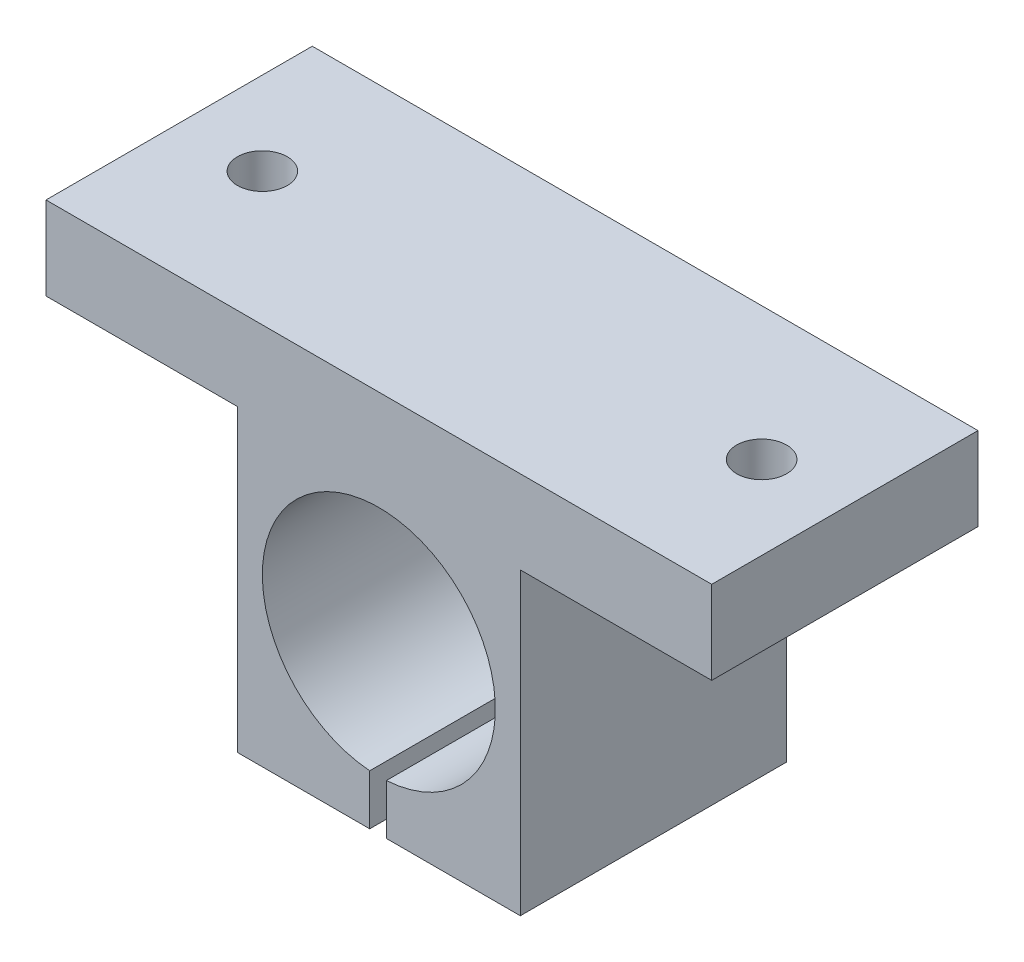
ISO-10303-21;
HEADER;
FILE_DESCRIPTION(('STEP AP214'),'2;1');
FILE_NAME('part.step','',(''),(''),'','','');
FILE_SCHEMA(('AUTOMOTIVE_DESIGN { 1 0 10303 214 1 1 1 1 }'));
ENDSEC;
DATA;
#1=APPLICATION_CONTEXT('core data for automotive mechanical design processes');
#2=APPLICATION_PROTOCOL_DEFINITION('international standard','automotive_design',2000,#1);
#3=PRODUCT_CONTEXT('',#1,'mechanical');
#4=PRODUCT('Part','Part','',(#3));
#5=PRODUCT_RELATED_PRODUCT_CATEGORY('part','',(#4));
#6=PRODUCT_DEFINITION_FORMATION('','',#4);
#7=PRODUCT_DEFINITION_CONTEXT('part definition',#1,'design');
#8=PRODUCT_DEFINITION('design','',#6,#7);
#9=PRODUCT_DEFINITION_SHAPE('','',#8);
#10=(LENGTH_UNIT() NAMED_UNIT(*) SI_UNIT(.MILLI.,.METRE.));
#11=(NAMED_UNIT(*) PLANE_ANGLE_UNIT() SI_UNIT($,.RADIAN.));
#12=(NAMED_UNIT(*) SI_UNIT($,.STERADIAN.) SOLID_ANGLE_UNIT());
#13=UNCERTAINTY_MEASURE_WITH_UNIT(LENGTH_MEASURE(1.E-05),#10,'distance_accuracy_value','');
#14=(GEOMETRIC_REPRESENTATION_CONTEXT(3) GLOBAL_UNCERTAINTY_ASSIGNED_CONTEXT((#13)) GLOBAL_UNIT_ASSIGNED_CONTEXT((#10,
#11,#12)) REPRESENTATION_CONTEXT('',''));
#15=CARTESIAN_POINT('',(0.,0.,0.));
#16=DIRECTION('',(0.,0.,1.));
#17=DIRECTION('',(1.,0.,0.));
#18=AXIS2_PLACEMENT_3D('',#15,#16,#17);
#19=CARTESIAN_POINT('',(8.50000000000001,8.,16.));
#20=DIRECTION('',(0.,1.,0.));
#21=DIRECTION('',(0.,0.,1.));
#22=AXIS2_PLACEMENT_3D('',#19,#20,#21);
#23=PLANE('',#22);
#24=DIRECTION('',(1.,0.,0.));
#25=VECTOR('',#24,1.);
#26=CARTESIAN_POINT('',(8.50000000000001,8.,0.));
#27=LINE('',#26,#25);
#28=CARTESIAN_POINT('',(8.50000000000001,8.,0.));
#29=VERTEX_POINT('',#28);
#30=CARTESIAN_POINT('',(20.,8.,0.));
#31=VERTEX_POINT('',#30);
#32=EDGE_CURVE('E159',#29,#31,#27,.T.);
#33=ORIENTED_EDGE('',*,*,#32,.T.);
#34=DIRECTION('',(0.,0.,-1.));
#35=VECTOR('',#34,1.);
#36=CARTESIAN_POINT('',(20.,8.,16.));
#37=LINE('',#36,#35);
#38=CARTESIAN_POINT('',(20.,8.,16.));
#39=VERTEX_POINT('',#38);
#40=EDGE_CURVE('E197',#39,#31,#37,.T.);
#41=ORIENTED_EDGE('',*,*,#40,.F.);
#42=DIRECTION('',(1.,0.,0.));
#43=VECTOR('',#42,1.);
#44=CARTESIAN_POINT('',(8.50000000000001,8.,16.));
#45=LINE('',#44,#43);
#46=CARTESIAN_POINT('',(8.50000000000001,8.,16.));
#47=VERTEX_POINT('',#46);
#48=EDGE_CURVE('E178',#47,#39,#45,.T.);
#49=ORIENTED_EDGE('',*,*,#48,.F.);
#50=DIRECTION('',(0.,0.,-1.));
#51=VECTOR('',#50,1.);
#52=CARTESIAN_POINT('',(8.50000000000001,8.,16.));
#53=LINE('',#52,#51);
#54=EDGE_CURVE('E158',#47,#29,#53,.T.);
#55=ORIENTED_EDGE('',*,*,#54,.T.);
#56=EDGE_LOOP('',(#33,#41,#49,#55));
#57=FACE_BOUND('',#56,.T.);
#58=CARTESIAN_POINT('',(15.,8.,8.));
#59=DIRECTION('',(0.,1.,0.));
#60=DIRECTION('',(-1.,0.,0.));
#61=AXIS2_PLACEMENT_3D('',#58,#59,#60);
#62=CIRCLE('',#61,1.5);
#63=CARTESIAN_POINT('',(13.5,8.,8.));
#64=VERTEX_POINT('',#63);
#65=EDGE_CURVE('E242',#64,#64,#62,.T.);
#66=ORIENTED_EDGE('',*,*,#65,.T.);
#67=EDGE_LOOP('',(#66));
#68=FACE_BOUND('',#67,.T.);
#69=ADVANCED_FACE('F37',(#57,#68),#23,.F.);
#70=CARTESIAN_POINT('',(-20.,13.,16.));
#71=DIRECTION('',(0.,-1.,0.));
#72=DIRECTION('',(0.,0.,-1.));
#73=AXIS2_PLACEMENT_3D('',#70,#71,#72);
#74=PLANE('',#73);
#75=DIRECTION('',(-1.,0.,0.));
#76=VECTOR('',#75,1.);
#77=CARTESIAN_POINT('',(-20.,13.,0.));
#78=LINE('',#77,#76);
#79=CARTESIAN_POINT('',(20.,13.,0.));
#80=VERTEX_POINT('',#79);
#81=CARTESIAN_POINT('',(-20.,13.,0.));
#82=VERTEX_POINT('',#81);
#83=EDGE_CURVE('E164',#80,#82,#78,.T.);
#84=ORIENTED_EDGE('',*,*,#83,.T.);
#85=DIRECTION('',(0.,0.,-1.));
#86=VECTOR('',#85,1.);
#87=CARTESIAN_POINT('',(-20.,13.,16.));
#88=LINE('',#87,#86);
#89=CARTESIAN_POINT('',(-20.,13.,16.));
#90=VERTEX_POINT('',#89);
#91=EDGE_CURVE('E191',#90,#82,#88,.T.);
#92=ORIENTED_EDGE('',*,*,#91,.F.);
#93=DIRECTION('',(-1.,0.,0.));
#94=VECTOR('',#93,1.);
#95=CARTESIAN_POINT('',(-20.,13.,16.));
#96=LINE('',#95,#94);
#97=CARTESIAN_POINT('',(20.,13.,16.));
#98=VERTEX_POINT('',#97);
#99=EDGE_CURVE('E216',#98,#90,#96,.T.);
#100=ORIENTED_EDGE('',*,*,#99,.F.);
#101=DIRECTION('',(0.,0.,-1.));
#102=VECTOR('',#101,1.);
#103=CARTESIAN_POINT('',(20.,13.,16.));
#104=LINE('',#103,#102);
#105=EDGE_CURVE('E194',#98,#80,#104,.T.);
#106=ORIENTED_EDGE('',*,*,#105,.T.);
#107=EDGE_LOOP('',(#84,#92,#100,#106));
#108=FACE_BOUND('',#107,.T.);
#109=CARTESIAN_POINT('',(-15.,13.,8.));
#110=DIRECTION('',(0.,-1.,0.));
#111=DIRECTION('',(0.,0.,-1.));
#112=AXIS2_PLACEMENT_3D('',#109,#110,#111);
#113=CIRCLE('',#112,1.5);
#114=CARTESIAN_POINT('',(-15.,13.,6.5));
#115=VERTEX_POINT('',#114);
#116=EDGE_CURVE('E142',#115,#115,#113,.T.);
#117=ORIENTED_EDGE('',*,*,#116,.T.);
#118=EDGE_LOOP('',(#117));
#119=FACE_BOUND('',#118,.T.);
#120=CARTESIAN_POINT('',(15.,13.,8.));
#121=DIRECTION('',(0.,-1.,0.));
#122=DIRECTION('',(0.,0.,-1.));
#123=AXIS2_PLACEMENT_3D('',#120,#121,#122);
#124=CIRCLE('',#123,1.5);
#125=CARTESIAN_POINT('',(15.,13.,6.5));
#126=VERTEX_POINT('',#125);
#127=EDGE_CURVE('E40',#126,#126,#124,.F.);
#128=ORIENTED_EDGE('',*,*,#127,.F.);
#129=EDGE_LOOP('',(#128));
#130=FACE_BOUND('',#129,.T.);
#131=ADVANCED_FACE('F251',(#108,#119,#130),#74,.F.);
#132=CARTESIAN_POINT('',(-8.49999999999999,-10.,16.));
#133=DIRECTION('',(0.,1.,0.));
#134=DIRECTION('',(-1.,0.,0.));
#135=AXIS2_PLACEMENT_3D('',#132,#133,#134);
#136=PLANE('',#135);
#137=DIRECTION('',(1.,0.,0.));
#138=VECTOR('',#137,1.);
#139=CARTESIAN_POINT('',(-8.49999999999999,-10.,16.));
#140=LINE('',#139,#138);
#141=CARTESIAN_POINT('',(0.451329237345476,-10.,16.));
#142=VERTEX_POINT('',#141);
#143=CARTESIAN_POINT('',(8.50000000000001,-10.,16.));
#144=VERTEX_POINT('',#143);
#145=EDGE_CURVE('E136',#142,#144,#140,.T.);
#146=ORIENTED_EDGE('',*,*,#145,.F.);
#147=DIRECTION('',(0.,0.,-1.));
#148=VECTOR('',#147,1.);
#149=CARTESIAN_POINT('',(0.451329237345475,-10.,16.));
#150=LINE('',#149,#148);
#151=CARTESIAN_POINT('',(0.451329237345476,-10.,0.));
#152=VERTEX_POINT('',#151);
#153=EDGE_CURVE('E123',#142,#152,#150,.T.);
#154=ORIENTED_EDGE('',*,*,#153,.T.);
#155=DIRECTION('',(1.,0.,0.));
#156=VECTOR('',#155,1.);
#157=CARTESIAN_POINT('',(-8.49999999999999,-10.,0.));
#158=LINE('',#157,#156);
#159=CARTESIAN_POINT('',(8.50000000000001,-10.,0.));
#160=VERTEX_POINT('',#159);
#161=EDGE_CURVE('E172',#152,#160,#158,.T.);
#162=ORIENTED_EDGE('',*,*,#161,.T.);
#163=DIRECTION('',(0.,0.,-1.));
#164=VECTOR('',#163,1.);
#165=CARTESIAN_POINT('',(8.50000000000001,-10.,16.));
#166=LINE('',#165,#164);
#167=EDGE_CURVE('E146',#144,#160,#166,.T.);
#168=ORIENTED_EDGE('',*,*,#167,.F.);
#169=EDGE_LOOP('',(#146,#154,#162,#168));
#170=FACE_BOUND('',#169,.T.);
#171=ADVANCED_FACE('F144',(#170),#136,.F.);
#172=CARTESIAN_POINT('',(0.,0.,16.));
#173=DIRECTION('',(0.,0.,1.));
#174=DIRECTION('',(1.,0.,0.));
#175=AXIS2_PLACEMENT_3D('',#172,#173,#174);
#176=PLANE('',#175);
#177=DIRECTION('',(0.,1.,0.));
#178=VECTOR('',#177,1.);
#179=CARTESIAN_POINT('',(0.451329237345476,-11.8680209149815,16.));
#180=LINE('',#179,#178);
#181=CARTESIAN_POINT('',(0.451329237345476,-6.98543498427386,16.));
#182=VERTEX_POINT('',#181);
#183=EDGE_CURVE('E59',#142,#182,#180,.T.);
#184=ORIENTED_EDGE('',*,*,#183,.F.);
#185=ORIENTED_EDGE('',*,*,#145,.T.);
#186=DIRECTION('',(0.,1.,0.));
#187=VECTOR('',#186,1.);
#188=CARTESIAN_POINT('',(8.50000000000001,-10.,16.));
#189=LINE('',#188,#187);
#190=EDGE_CURVE('E152',#144,#47,#189,.T.);
#191=ORIENTED_EDGE('',*,*,#190,.T.);
#192=ORIENTED_EDGE('',*,*,#48,.T.);
#193=DIRECTION('',(0.,1.,0.));
#194=VECTOR('',#193,1.);
#195=CARTESIAN_POINT('',(20.,8.,16.));
#196=LINE('',#195,#194);
#197=EDGE_CURVE('E214',#39,#98,#196,.T.);
#198=ORIENTED_EDGE('',*,*,#197,.T.);
#199=ORIENTED_EDGE('',*,*,#99,.T.);
#200=DIRECTION('',(0.,-1.,0.));
#201=VECTOR('',#200,1.);
#202=CARTESIAN_POINT('',(-20.,8.,16.));
#203=LINE('',#202,#201);
#204=CARTESIAN_POINT('',(-20.,8.,16.));
#205=VERTEX_POINT('',#204);
#206=EDGE_CURVE('E218',#90,#205,#203,.T.);
#207=ORIENTED_EDGE('',*,*,#206,.T.);
#208=DIRECTION('',(1.,0.,0.));
#209=VECTOR('',#208,1.);
#210=CARTESIAN_POINT('',(-20.,8.,16.));
#211=LINE('',#210,#209);
#212=CARTESIAN_POINT('',(-8.49999999999999,8.,16.));
#213=VERTEX_POINT('',#212);
#214=EDGE_CURVE('E153',#205,#213,#211,.T.);
#215=ORIENTED_EDGE('',*,*,#214,.T.);
#216=DIRECTION('',(0.,-1.,0.));
#217=VECTOR('',#216,1.);
#218=CARTESIAN_POINT('',(-8.49999999999999,-10.,16.));
#219=LINE('',#218,#217);
#220=CARTESIAN_POINT('',(-8.49999999999999,-10.,16.));
#221=VERTEX_POINT('',#220);
#222=EDGE_CURVE('E149',#213,#221,#219,.T.);
#223=ORIENTED_EDGE('',*,*,#222,.T.);
#224=CARTESIAN_POINT('',(-0.548670762654524,-10.,16.));
#225=VERTEX_POINT('',#224);
#226=EDGE_CURVE('E148',#221,#225,#140,.T.);
#227=ORIENTED_EDGE('',*,*,#226,.T.);
#228=DIRECTION('',(0.,-1.,0.));
#229=VECTOR('',#228,1.);
#230=CARTESIAN_POINT('',(-0.548670762654524,-11.8680209149815,16.));
#231=LINE('',#230,#229);
#232=CARTESIAN_POINT('',(-0.548670762654524,-6.97846404262486,16.));
#233=VERTEX_POINT('',#232);
#234=EDGE_CURVE('E141',#233,#225,#231,.T.);
#235=ORIENTED_EDGE('',*,*,#234,.F.);
#236=CARTESIAN_POINT('',(0.,0.,16.));
#237=DIRECTION('',(0.,0.,1.));
#238=DIRECTION('',(1.,0.,0.));
#239=AXIS2_PLACEMENT_3D('',#236,#237,#238);
#240=CIRCLE('',#239,7.);
#241=EDGE_CURVE('E140',#182,#233,#240,.T.);
#242=ORIENTED_EDGE('',*,*,#241,.F.);
#243=EDGE_LOOP('',(#184,#185,#191,#192,#198,#199,#207,#215,#223,#227,#235,#242));
#244=FACE_BOUND('',#243,.T.);
#245=ADVANCED_FACE('F135',(#244),#176,.T.);
#246=CARTESIAN_POINT('',(0.,0.,0.));
#247=DIRECTION('',(0.,0.,1.));
#248=DIRECTION('',(1.,0.,0.));
#249=AXIS2_PLACEMENT_3D('',#246,#247,#248);
#250=PLANE('',#249);
#251=ORIENTED_EDGE('',*,*,#161,.F.);
#252=DIRECTION('',(0.,1.,0.));
#253=VECTOR('',#252,1.);
#254=CARTESIAN_POINT('',(0.451329237345476,-11.8680209149815,0.));
#255=LINE('',#254,#253);
#256=CARTESIAN_POINT('',(0.451329237345476,-6.98543498427386,0.));
#257=VERTEX_POINT('',#256);
#258=EDGE_CURVE('E126',#152,#257,#255,.T.);
#259=ORIENTED_EDGE('',*,*,#258,.T.);
#260=CARTESIAN_POINT('',(0.,0.,0.));
#261=DIRECTION('',(0.,0.,1.));
#262=DIRECTION('',(1.,0.,0.));
#263=AXIS2_PLACEMENT_3D('',#260,#261,#262);
#264=CIRCLE('',#263,7.);
#265=CARTESIAN_POINT('',(-0.548670762654524,-6.97846404262486,0.));
#266=VERTEX_POINT('',#265);
#267=EDGE_CURVE('E130',#257,#266,#264,.T.);
#268=ORIENTED_EDGE('',*,*,#267,.T.);
#269=DIRECTION('',(0.,-1.,0.));
#270=VECTOR('',#269,1.);
#271=CARTESIAN_POINT('',(-0.548670762654524,-11.8680209149815,0.));
#272=LINE('',#271,#270);
#273=CARTESIAN_POINT('',(-0.548670762654524,-10.,0.));
#274=VERTEX_POINT('',#273);
#275=EDGE_CURVE('E52',#266,#274,#272,.T.);
#276=ORIENTED_EDGE('',*,*,#275,.T.);
#277=CARTESIAN_POINT('',(-8.49999999999999,-10.,0.));
#278=VERTEX_POINT('',#277);
#279=EDGE_CURVE('E173',#278,#274,#158,.T.);
#280=ORIENTED_EDGE('',*,*,#279,.F.);
#281=DIRECTION('',(0.,-1.,0.));
#282=VECTOR('',#281,1.);
#283=CARTESIAN_POINT('',(-8.49999999999999,-10.,0.));
#284=LINE('',#283,#282);
#285=CARTESIAN_POINT('',(-8.49999999999999,8.,0.));
#286=VERTEX_POINT('',#285);
#287=EDGE_CURVE('E170',#286,#278,#284,.T.);
#288=ORIENTED_EDGE('',*,*,#287,.F.);
#289=DIRECTION('',(1.,0.,0.));
#290=VECTOR('',#289,1.);
#291=CARTESIAN_POINT('',(-20.,8.,0.));
#292=LINE('',#291,#290);
#293=CARTESIAN_POINT('',(-20.,8.,0.));
#294=VERTEX_POINT('',#293);
#295=EDGE_CURVE('E168',#294,#286,#292,.T.);
#296=ORIENTED_EDGE('',*,*,#295,.F.);
#297=DIRECTION('',(0.,-1.,0.));
#298=VECTOR('',#297,1.);
#299=CARTESIAN_POINT('',(-20.,8.,0.));
#300=LINE('',#299,#298);
#301=EDGE_CURVE('E166',#82,#294,#300,.T.);
#302=ORIENTED_EDGE('',*,*,#301,.F.);
#303=ORIENTED_EDGE('',*,*,#83,.F.);
#304=DIRECTION('',(0.,1.,0.));
#305=VECTOR('',#304,1.);
#306=CARTESIAN_POINT('',(20.,8.,0.));
#307=LINE('',#306,#305);
#308=EDGE_CURVE('E162',#31,#80,#307,.T.);
#309=ORIENTED_EDGE('',*,*,#308,.F.);
#310=ORIENTED_EDGE('',*,*,#32,.F.);
#311=DIRECTION('',(0.,1.,0.));
#312=VECTOR('',#311,1.);
#313=CARTESIAN_POINT('',(8.50000000000001,-10.,0.));
#314=LINE('',#313,#312);
#315=EDGE_CURVE('E176',#160,#29,#314,.T.);
#316=ORIENTED_EDGE('',*,*,#315,.F.);
#317=EDGE_LOOP('',(#251,#259,#268,#276,#280,#288,#296,#302,#303,#309,#310,#316));
#318=FACE_BOUND('',#317,.T.);
#319=ADVANCED_FACE('F267',(#318),#250,.F.);
#320=CARTESIAN_POINT('',(20.,8.,16.));
#321=DIRECTION('',(-1.,0.,0.));
#322=DIRECTION('',(0.,0.,1.));
#323=AXIS2_PLACEMENT_3D('',#320,#321,#322);
#324=PLANE('',#323);
#325=ORIENTED_EDGE('',*,*,#308,.T.);
#326=ORIENTED_EDGE('',*,*,#105,.F.);
#327=ORIENTED_EDGE('',*,*,#197,.F.);
#328=ORIENTED_EDGE('',*,*,#40,.T.);
#329=EDGE_LOOP('',(#325,#326,#327,#328));
#330=FACE_BOUND('',#329,.T.);
#331=ADVANCED_FACE('F265',(#330),#324,.F.);
#332=CARTESIAN_POINT('',(-20.,8.,16.));
#333=DIRECTION('',(1.,0.,0.));
#334=DIRECTION('',(0.,0.,-1.));
#335=AXIS2_PLACEMENT_3D('',#332,#333,#334);
#336=PLANE('',#335);
#337=ORIENTED_EDGE('',*,*,#301,.T.);
#338=DIRECTION('',(0.,0.,-1.));
#339=VECTOR('',#338,1.);
#340=CARTESIAN_POINT('',(-20.,8.,16.));
#341=LINE('',#340,#339);
#342=EDGE_CURVE('E188',#205,#294,#341,.T.);
#343=ORIENTED_EDGE('',*,*,#342,.F.);
#344=ORIENTED_EDGE('',*,*,#206,.F.);
#345=ORIENTED_EDGE('',*,*,#91,.T.);
#346=EDGE_LOOP('',(#337,#343,#344,#345));
#347=FACE_BOUND('',#346,.T.);
#348=ADVANCED_FACE('F263',(#347),#336,.F.);
#349=CARTESIAN_POINT('',(-20.,8.,16.));
#350=DIRECTION('',(0.,1.,0.));
#351=DIRECTION('',(-1.,0.,0.));
#352=AXIS2_PLACEMENT_3D('',#349,#350,#351);
#353=PLANE('',#352);
#354=CARTESIAN_POINT('',(-15.,8.,8.));
#355=DIRECTION('',(0.,-1.,0.));
#356=DIRECTION('',(1.,0.,0.));
#357=AXIS2_PLACEMENT_3D('',#354,#355,#356);
#358=CIRCLE('',#357,1.5);
#359=CARTESIAN_POINT('',(-13.5,8.,8.));
#360=VERTEX_POINT('',#359);
#361=EDGE_CURVE('E239',#360,#360,#358,.T.);
#362=ORIENTED_EDGE('',*,*,#361,.F.);
#363=EDGE_LOOP('',(#362));
#364=FACE_BOUND('',#363,.T.);
#365=ORIENTED_EDGE('',*,*,#295,.T.);
#366=DIRECTION('',(0.,0.,-1.));
#367=VECTOR('',#366,1.);
#368=CARTESIAN_POINT('',(-8.49999999999999,8.,16.));
#369=LINE('',#368,#367);
#370=EDGE_CURVE('E185',#213,#286,#369,.T.);
#371=ORIENTED_EDGE('',*,*,#370,.F.);
#372=ORIENTED_EDGE('',*,*,#214,.F.);
#373=ORIENTED_EDGE('',*,*,#342,.T.);
#374=EDGE_LOOP('',(#365,#371,#372,#373));
#375=FACE_BOUND('',#374,.T.);
#376=ADVANCED_FACE('F226',(#364,#375),#353,.F.);
#377=CARTESIAN_POINT('',(-8.49999999999999,-10.,16.));
#378=DIRECTION('',(1.,0.,0.));
#379=DIRECTION('',(0.,0.,-1.));
#380=AXIS2_PLACEMENT_3D('',#377,#378,#379);
#381=PLANE('',#380);
#382=ORIENTED_EDGE('',*,*,#287,.T.);
#383=DIRECTION('',(0.,0.,-1.));
#384=VECTOR('',#383,1.);
#385=CARTESIAN_POINT('',(-8.49999999999999,-10.,16.));
#386=LINE('',#385,#384);
#387=EDGE_CURVE('E182',#221,#278,#386,.T.);
#388=ORIENTED_EDGE('',*,*,#387,.F.);
#389=ORIENTED_EDGE('',*,*,#222,.F.);
#390=ORIENTED_EDGE('',*,*,#370,.T.);
#391=EDGE_LOOP('',(#382,#388,#389,#390));
#392=FACE_BOUND('',#391,.T.);
#393=ADVANCED_FACE('F230',(#392),#381,.F.);
#394=ORIENTED_EDGE('',*,*,#279,.T.);
#395=DIRECTION('',(0.,0.,1.));
#396=VECTOR('',#395,1.);
#397=CARTESIAN_POINT('',(-0.548670762654524,-10.,16.));
#398=LINE('',#397,#396);
#399=EDGE_CURVE('E131',#274,#225,#398,.T.);
#400=ORIENTED_EDGE('',*,*,#399,.T.);
#401=ORIENTED_EDGE('',*,*,#226,.F.);
#402=ORIENTED_EDGE('',*,*,#387,.T.);
#403=EDGE_LOOP('',(#394,#400,#401,#402));
#404=FACE_BOUND('',#403,.T.);
#405=ADVANCED_FACE('F233',(#404),#136,.F.);
#406=CARTESIAN_POINT('',(8.50000000000001,-10.,16.));
#407=DIRECTION('',(-1.,0.,0.));
#408=DIRECTION('',(0.,-1.,0.));
#409=AXIS2_PLACEMENT_3D('',#406,#407,#408);
#410=PLANE('',#409);
#411=ORIENTED_EDGE('',*,*,#315,.T.);
#412=ORIENTED_EDGE('',*,*,#54,.F.);
#413=ORIENTED_EDGE('',*,*,#190,.F.);
#414=ORIENTED_EDGE('',*,*,#167,.T.);
#415=EDGE_LOOP('',(#411,#412,#413,#414));
#416=FACE_BOUND('',#415,.T.);
#417=ADVANCED_FACE('F285',(#416),#410,.F.);
#418=CARTESIAN_POINT('',(0.,0.,16.));
#419=DIRECTION('',(0.,0.,-1.));
#420=DIRECTION('',(-1.,0.,0.));
#421=AXIS2_PLACEMENT_3D('',#418,#419,#420);
#422=CYLINDRICAL_SURFACE('',#421,7.);
#423=DIRECTION('',(0.,0.,-1.));
#424=VECTOR('',#423,1.);
#425=CARTESIAN_POINT('',(0.451329237345476,-6.98543498427386,16.));
#426=LINE('',#425,#424);
#427=EDGE_CURVE('E11',#182,#257,#426,.T.);
#428=ORIENTED_EDGE('',*,*,#427,.F.);
#429=ORIENTED_EDGE('',*,*,#241,.T.);
#430=DIRECTION('',(0.,0.,-1.));
#431=VECTOR('',#430,1.);
#432=CARTESIAN_POINT('',(-0.548670762654524,-6.97846404262486,16.));
#433=LINE('',#432,#431);
#434=EDGE_CURVE('E45',#266,#233,#433,.F.);
#435=ORIENTED_EDGE('',*,*,#434,.F.);
#436=ORIENTED_EDGE('',*,*,#267,.F.);
#437=EDGE_LOOP('',(#428,#429,#435,#436));
#438=FACE_BOUND('',#437,.T.);
#439=ADVANCED_FACE('F207',(#438),#422,.F.);
#440=CARTESIAN_POINT('',(-0.548670762654524,-11.8680209149815,0.));
#441=DIRECTION('',(-1.,0.,0.));
#442=DIRECTION('',(0.,0.,1.));
#443=AXIS2_PLACEMENT_3D('',#440,#441,#442);
#444=PLANE('',#443);
#445=ORIENTED_EDGE('',*,*,#275,.F.);
#446=ORIENTED_EDGE('',*,*,#434,.T.);
#447=ORIENTED_EDGE('',*,*,#234,.T.);
#448=ORIENTED_EDGE('',*,*,#399,.F.);
#449=EDGE_LOOP('',(#445,#446,#447,#448));
#450=FACE_BOUND('',#449,.T.);
#451=ADVANCED_FACE('F200',(#450),#444,.F.);
#452=CARTESIAN_POINT('',(0.451329237345476,-11.8680209149815,0.));
#453=DIRECTION('',(1.,0.,0.));
#454=DIRECTION('',(0.,0.,-1.));
#455=AXIS2_PLACEMENT_3D('',#452,#453,#454);
#456=PLANE('',#455);
#457=ORIENTED_EDGE('',*,*,#183,.T.);
#458=ORIENTED_EDGE('',*,*,#427,.T.);
#459=ORIENTED_EDGE('',*,*,#258,.F.);
#460=ORIENTED_EDGE('',*,*,#153,.F.);
#461=EDGE_LOOP('',(#457,#458,#459,#460));
#462=FACE_BOUND('',#461,.T.);
#463=ADVANCED_FACE('F124',(#462),#456,.F.);
#464=CARTESIAN_POINT('',(-15.,24.,8.));
#465=DIRECTION('',(0.,-1.,0.));
#466=DIRECTION('',(1.,0.,0.));
#467=AXIS2_PLACEMENT_3D('',#464,#465,#466);
#468=CYLINDRICAL_SURFACE('',#467,1.5);
#469=ORIENTED_EDGE('',*,*,#361,.T.);
#470=EDGE_LOOP('',(#469));
#471=FACE_BOUND('',#470,.T.);
#472=ORIENTED_EDGE('',*,*,#116,.F.);
#473=EDGE_LOOP('',(#472));
#474=FACE_BOUND('',#473,.T.);
#475=ADVANCED_FACE('F304',(#471,#474),#468,.F.);
#476=CARTESIAN_POINT('',(15.,24.,8.));
#477=DIRECTION('',(0.,-1.,0.));
#478=DIRECTION('',(1.,0.,0.));
#479=AXIS2_PLACEMENT_3D('',#476,#477,#478);
#480=CYLINDRICAL_SURFACE('',#479,1.5);
#481=ORIENTED_EDGE('',*,*,#65,.F.);
#482=EDGE_LOOP('',(#481));
#483=FACE_BOUND('',#482,.T.);
#484=ORIENTED_EDGE('',*,*,#127,.T.);
#485=EDGE_LOOP('',(#484));
#486=FACE_BOUND('',#485,.T.);
#487=ADVANCED_FACE('F249',(#483,#486),#480,.F.);
#488=CLOSED_SHELL('',(#69,#131,#171,#245,#319,#331,#348,#376,#393,#405,#417,#439,#451,#463,#475,#487));
#489=MANIFOLD_SOLID_BREP('B2',#488);
#490=ADVANCED_BREP_SHAPE_REPRESENTATION('',(#18,#489),#14);
#491=SHAPE_DEFINITION_REPRESENTATION(#9,#490);
ENDSEC;
END-ISO-10303-21;
